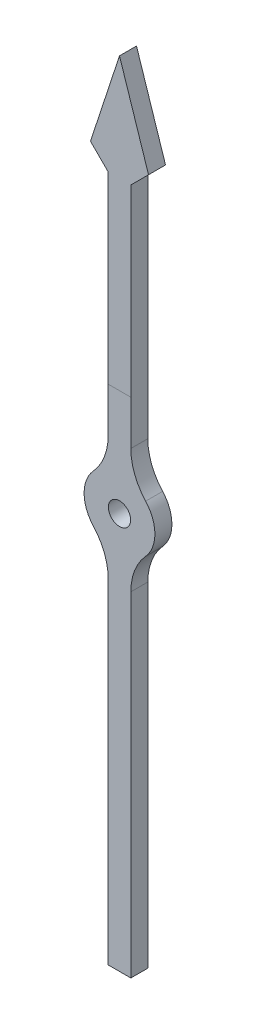
ISO-10303-21;
HEADER;
FILE_DESCRIPTION(('STEP AP214'),'2;1');
FILE_NAME('part.step','',(''),(''),'','','');
FILE_SCHEMA(('AUTOMOTIVE_DESIGN { 1 0 10303 214 1 1 1 1 }'));
ENDSEC;
DATA;
#1=APPLICATION_CONTEXT('core data for automotive mechanical design processes');
#2=APPLICATION_PROTOCOL_DEFINITION('international standard','automotive_design',2000,#1);
#3=PRODUCT_CONTEXT('',#1,'mechanical');
#4=PRODUCT('Part','Part','',(#3));
#5=PRODUCT_RELATED_PRODUCT_CATEGORY('part','',(#4));
#6=PRODUCT_DEFINITION_FORMATION('','',#4);
#7=PRODUCT_DEFINITION_CONTEXT('part definition',#1,'design');
#8=PRODUCT_DEFINITION('design','',#6,#7);
#9=PRODUCT_DEFINITION_SHAPE('','',#8);
#10=(LENGTH_UNIT() NAMED_UNIT(*) SI_UNIT(.MILLI.,.METRE.));
#11=(NAMED_UNIT(*) PLANE_ANGLE_UNIT() SI_UNIT($,.RADIAN.));
#12=(NAMED_UNIT(*) SI_UNIT($,.STERADIAN.) SOLID_ANGLE_UNIT());
#13=UNCERTAINTY_MEASURE_WITH_UNIT(LENGTH_MEASURE(1.E-05),#10,'distance_accuracy_value','');
#14=(GEOMETRIC_REPRESENTATION_CONTEXT(3) GLOBAL_UNCERTAINTY_ASSIGNED_CONTEXT((#13)) GLOBAL_UNIT_ASSIGNED_CONTEXT((#10,
#11,#12)) REPRESENTATION_CONTEXT('',''));
#15=CARTESIAN_POINT('',(0.,0.,0.));
#16=DIRECTION('',(0.,0.,1.));
#17=DIRECTION('',(1.,0.,0.));
#18=AXIS2_PLACEMENT_3D('',#15,#16,#17);
#19=CARTESIAN_POINT('',(0.,0.,0.762));
#20=DIRECTION('',(0.,0.,1.));
#21=DIRECTION('',(1.,0.,0.));
#22=AXIS2_PLACEMENT_3D('',#19,#20,#21);
#23=PLANE('',#22);
#24=CARTESIAN_POINT('',(0.,0.,0.762));
#25=DIRECTION('',(0.,0.,1.));
#26=DIRECTION('',(1.,0.,0.));
#27=AXIS2_PLACEMENT_3D('',#24,#25,#26);
#28=CIRCLE('',#27,0.5);
#29=CARTESIAN_POINT('',(0.5,0.,0.762));
#30=VERTEX_POINT('',#29);
#31=EDGE_CURVE('E201',#30,#30,#28,.T.);
#32=ORIENTED_EDGE('',*,*,#31,.F.);
#33=EDGE_LOOP('',(#32));
#34=FACE_BOUND('',#33,.T.);
#35=CARTESIAN_POINT('',(0.,0.,0.762));
#36=DIRECTION('',(0.,0.,1.));
#37=DIRECTION('',(1.,0.,0.));
#38=AXIS2_PLACEMENT_3D('',#35,#36,#37);
#39=CIRCLE('',#38,1.5875);
#40=CARTESIAN_POINT('',(1.17230769230769,-1.07044426503962,0.762));
#41=VERTEX_POINT('',#40);
#42=CARTESIAN_POINT('',(1.17230769230769,1.07044426503962,0.762));
#43=VERTEX_POINT('',#42);
#44=EDGE_CURVE('E160',#41,#43,#39,.T.);
#45=ORIENTED_EDGE('',*,*,#44,.T.);
#46=CARTESIAN_POINT('',(3.048,2.78315508910301,0.762));
#47=DIRECTION('',(0.,0.,1.));
#48=DIRECTION('',(1.,0.,0.));
#49=AXIS2_PLACEMENT_3D('',#46,#47,#48);
#50=CIRCLE('',#49,2.54);
#51=CARTESIAN_POINT('',(0.508,2.78315508910301,0.762));
#52=VERTEX_POINT('',#51);
#53=EDGE_CURVE('E268',#43,#52,#50,.F.);
#54=ORIENTED_EDGE('',*,*,#53,.T.);
#55=DIRECTION('',(0.,1.,0.));
#56=VECTOR('',#55,1.);
#57=CARTESIAN_POINT('',(0.508,1.50402534885553,0.762));
#58=LINE('',#57,#56);
#59=CARTESIAN_POINT('',(0.508,4.7752,0.762));
#60=VERTEX_POINT('',#59);
#61=EDGE_CURVE('E159',#52,#60,#58,.T.);
#62=ORIENTED_EDGE('',*,*,#61,.T.);
#63=DIRECTION('',(-1.,0.,0.));
#64=VECTOR('',#63,1.);
#65=CARTESIAN_POINT('',(0.,4.7752,0.762));
#66=LINE('',#65,#64);
#67=CARTESIAN_POINT('',(-0.508,4.7752,0.762));
#68=VERTEX_POINT('',#67);
#69=EDGE_CURVE('E156',#60,#68,#66,.T.);
#70=ORIENTED_EDGE('',*,*,#69,.T.);
#71=DIRECTION('',(0.,-1.,0.));
#72=VECTOR('',#71,1.);
#73=CARTESIAN_POINT('',(-0.508,1.50402534885553,0.762));
#74=LINE('',#73,#72);
#75=CARTESIAN_POINT('',(-0.508,2.78315508910301,0.762));
#76=VERTEX_POINT('',#75);
#77=EDGE_CURVE('E184',#68,#76,#74,.T.);
#78=ORIENTED_EDGE('',*,*,#77,.T.);
#79=CARTESIAN_POINT('',(-3.048,2.78315508910301,0.762));
#80=DIRECTION('',(0.,0.,1.));
#81=DIRECTION('',(1.,0.,0.));
#82=AXIS2_PLACEMENT_3D('',#79,#80,#81);
#83=CIRCLE('',#82,2.54);
#84=CARTESIAN_POINT('',(-1.17230769230769,1.07044426503962,0.762));
#85=VERTEX_POINT('',#84);
#86=EDGE_CURVE('E11',#76,#85,#83,.F.);
#87=ORIENTED_EDGE('',*,*,#86,.T.);
#88=CARTESIAN_POINT('',(0.,0.,0.762));
#89=DIRECTION('',(0.,0.,1.));
#90=DIRECTION('',(1.,0.,0.));
#91=AXIS2_PLACEMENT_3D('',#88,#89,#90);
#92=CIRCLE('',#91,1.5875);
#93=CARTESIAN_POINT('',(-1.17230769230769,-1.07044426503962,0.762));
#94=VERTEX_POINT('',#93);
#95=EDGE_CURVE('E187',#85,#94,#92,.T.);
#96=ORIENTED_EDGE('',*,*,#95,.T.);
#97=CARTESIAN_POINT('',(-3.048,-2.78315508910301,0.762));
#98=DIRECTION('',(0.,0.,1.));
#99=DIRECTION('',(1.,0.,0.));
#100=AXIS2_PLACEMENT_3D('',#97,#98,#99);
#101=CIRCLE('',#100,2.54);
#102=CARTESIAN_POINT('',(-0.508,-2.78315508910301,0.762));
#103=VERTEX_POINT('',#102);
#104=EDGE_CURVE('E260',#94,#103,#101,.F.);
#105=ORIENTED_EDGE('',*,*,#104,.T.);
#106=DIRECTION('',(0.,-1.,0.));
#107=VECTOR('',#106,1.);
#108=CARTESIAN_POINT('',(-0.508,-1.50402534885553,0.762));
#109=LINE('',#108,#107);
#110=CARTESIAN_POINT('',(-0.507999999999998,-17.78,0.762));
#111=VERTEX_POINT('',#110);
#112=EDGE_CURVE('E190',#103,#111,#109,.T.);
#113=ORIENTED_EDGE('',*,*,#112,.T.);
#114=DIRECTION('',(1.,0.,0.));
#115=VECTOR('',#114,1.);
#116=CARTESIAN_POINT('',(-0.507999999999998,-17.78,0.762));
#117=LINE('',#116,#115);
#118=CARTESIAN_POINT('',(0.508000000000002,-17.78,0.762));
#119=VERTEX_POINT('',#118);
#120=EDGE_CURVE('E192',#111,#119,#117,.T.);
#121=ORIENTED_EDGE('',*,*,#120,.T.);
#122=DIRECTION('',(0.,1.,0.));
#123=VECTOR('',#122,1.);
#124=CARTESIAN_POINT('',(0.508,-1.50402534885553,0.762));
#125=LINE('',#124,#123);
#126=CARTESIAN_POINT('',(0.508,-2.78315508910301,0.762));
#127=VERTEX_POINT('',#126);
#128=EDGE_CURVE('E194',#119,#127,#125,.T.);
#129=ORIENTED_EDGE('',*,*,#128,.T.);
#130=CARTESIAN_POINT('',(3.048,-2.78315508910301,0.762));
#131=DIRECTION('',(0.,0.,1.));
#132=DIRECTION('',(1.,0.,0.));
#133=AXIS2_PLACEMENT_3D('',#130,#131,#132);
#134=CIRCLE('',#133,2.54);
#135=EDGE_CURVE('E264',#127,#41,#134,.F.);
#136=ORIENTED_EDGE('',*,*,#135,.T.);
#137=EDGE_LOOP('',(#45,#54,#62,#70,#78,#87,#96,#105,#113,#121,#129,#136));
#138=FACE_BOUND('',#137,.T.);
#139=ADVANCED_FACE('F36',(#34,#138),#23,.T.);
#140=ORIENTED_EDGE('',*,*,#69,.F.);
#141=CARTESIAN_POINT('',(0.508,13.0175,0.762));
#142=VERTEX_POINT('',#141);
#143=EDGE_CURVE('E149',#60,#142,#58,.T.);
#144=ORIENTED_EDGE('',*,*,#143,.T.);
#145=DIRECTION('',(0.707106781186548,0.707106781186547,0.));
#146=VECTOR('',#145,1.);
#147=CARTESIAN_POINT('',(0.508,13.0175,0.762));
#148=LINE('',#147,#146);
#149=CARTESIAN_POINT('',(1.30175,13.81125,0.762));
#150=VERTEX_POINT('',#149);
#151=EDGE_CURVE('E153',#142,#150,#148,.T.);
#152=ORIENTED_EDGE('',*,*,#151,.T.);
#153=DIRECTION('',(-0.311663186766481,0.950192642580735,0.));
#154=VECTOR('',#153,1.);
#155=CARTESIAN_POINT('',(1.30175,13.81125,0.762));
#156=LINE('',#155,#154);
#157=CARTESIAN_POINT('',(0.,17.78,0.762));
#158=VERTEX_POINT('',#157);
#159=EDGE_CURVE('E175',#150,#158,#156,.T.);
#160=ORIENTED_EDGE('',*,*,#159,.T.);
#161=DIRECTION('',(-0.311663186766481,-0.950192642580735,0.));
#162=VECTOR('',#161,1.);
#163=CARTESIAN_POINT('',(-1.30175,13.81125,0.762));
#164=LINE('',#163,#162);
#165=CARTESIAN_POINT('',(-1.30175,13.81125,0.762));
#166=VERTEX_POINT('',#165);
#167=EDGE_CURVE('E177',#158,#166,#164,.T.);
#168=ORIENTED_EDGE('',*,*,#167,.T.);
#169=DIRECTION('',(0.707106781186548,-0.707106781186547,0.));
#170=VECTOR('',#169,1.);
#171=CARTESIAN_POINT('',(-0.508,13.0175,0.762));
#172=LINE('',#171,#170);
#173=CARTESIAN_POINT('',(-0.508,13.0175,0.762));
#174=VERTEX_POINT('',#173);
#175=EDGE_CURVE('E182',#166,#174,#172,.T.);
#176=ORIENTED_EDGE('',*,*,#175,.T.);
#177=EDGE_CURVE('E185',#174,#68,#74,.T.);
#178=ORIENTED_EDGE('',*,*,#177,.T.);
#179=EDGE_LOOP('',(#140,#144,#152,#160,#168,#176,#178));
#180=FACE_BOUND('',#179,.T.);
#181=ADVANCED_FACE('F151',(#180),#23,.T.);
#182=CARTESIAN_POINT('',(0.,0.,0.));
#183=DIRECTION('',(0.,0.,1.));
#184=DIRECTION('',(1.,0.,0.));
#185=AXIS2_PLACEMENT_3D('',#182,#183,#184);
#186=PLANE('',#185);
#187=CARTESIAN_POINT('',(0.,0.,0.));
#188=DIRECTION('',(0.,0.,1.));
#189=DIRECTION('',(1.,0.,0.));
#190=AXIS2_PLACEMENT_3D('',#187,#188,#189);
#191=CIRCLE('',#190,1.5875);
#192=CARTESIAN_POINT('',(1.17230769230769,-1.07044426503962,0.));
#193=VERTEX_POINT('',#192);
#194=CARTESIAN_POINT('',(1.17230769230769,1.07044426503962,0.));
#195=VERTEX_POINT('',#194);
#196=EDGE_CURVE('E198',#193,#195,#191,.T.);
#197=ORIENTED_EDGE('',*,*,#196,.F.);
#198=CARTESIAN_POINT('',(3.048,-2.78315508910301,0.));
#199=DIRECTION('',(0.,0.,1.));
#200=DIRECTION('',(1.,0.,0.));
#201=AXIS2_PLACEMENT_3D('',#198,#199,#200);
#202=CIRCLE('',#201,2.54);
#203=CARTESIAN_POINT('',(0.508,-2.78315508910301,0.));
#204=VERTEX_POINT('',#203);
#205=EDGE_CURVE('E262',#193,#204,#202,.T.);
#206=ORIENTED_EDGE('',*,*,#205,.T.);
#207=DIRECTION('',(0.,1.,0.));
#208=VECTOR('',#207,1.);
#209=CARTESIAN_POINT('',(0.508,-1.50402534885553,0.));
#210=LINE('',#209,#208);
#211=CARTESIAN_POINT('',(0.508000000000002,-17.78,0.));
#212=VERTEX_POINT('',#211);
#213=EDGE_CURVE('E220',#212,#204,#210,.T.);
#214=ORIENTED_EDGE('',*,*,#213,.F.);
#215=DIRECTION('',(1.,0.,0.));
#216=VECTOR('',#215,1.);
#217=CARTESIAN_POINT('',(-0.507999999999998,-17.78,0.));
#218=LINE('',#217,#216);
#219=CARTESIAN_POINT('',(-0.507999999999998,-17.78,0.));
#220=VERTEX_POINT('',#219);
#221=EDGE_CURVE('E218',#220,#212,#218,.T.);
#222=ORIENTED_EDGE('',*,*,#221,.F.);
#223=DIRECTION('',(0.,-1.,0.));
#224=VECTOR('',#223,1.);
#225=CARTESIAN_POINT('',(-0.508,-1.50402534885553,0.));
#226=LINE('',#225,#224);
#227=CARTESIAN_POINT('',(-0.508,-2.78315508910301,0.));
#228=VERTEX_POINT('',#227);
#229=EDGE_CURVE('E216',#228,#220,#226,.T.);
#230=ORIENTED_EDGE('',*,*,#229,.F.);
#231=CARTESIAN_POINT('',(-3.048,-2.78315508910301,0.));
#232=DIRECTION('',(0.,0.,1.));
#233=DIRECTION('',(1.,0.,0.));
#234=AXIS2_PLACEMENT_3D('',#231,#232,#233);
#235=CIRCLE('',#234,2.54);
#236=CARTESIAN_POINT('',(-1.17230769230769,-1.07044426503962,0.));
#237=VERTEX_POINT('',#236);
#238=EDGE_CURVE('E258',#228,#237,#235,.T.);
#239=ORIENTED_EDGE('',*,*,#238,.T.);
#240=CARTESIAN_POINT('',(0.,0.,0.));
#241=DIRECTION('',(0.,0.,1.));
#242=DIRECTION('',(1.,0.,0.));
#243=AXIS2_PLACEMENT_3D('',#240,#241,#242);
#244=CIRCLE('',#243,1.5875);
#245=CARTESIAN_POINT('',(-1.17230769230769,1.07044426503962,0.));
#246=VERTEX_POINT('',#245);
#247=EDGE_CURVE('E213',#246,#237,#244,.T.);
#248=ORIENTED_EDGE('',*,*,#247,.F.);
#249=CARTESIAN_POINT('',(-3.048,2.78315508910301,0.));
#250=DIRECTION('',(0.,0.,1.));
#251=DIRECTION('',(1.,0.,0.));
#252=AXIS2_PLACEMENT_3D('',#249,#250,#251);
#253=CIRCLE('',#252,2.54);
#254=CARTESIAN_POINT('',(-0.508,2.78315508910301,0.));
#255=VERTEX_POINT('',#254);
#256=EDGE_CURVE('E44',#246,#255,#253,.T.);
#257=ORIENTED_EDGE('',*,*,#256,.T.);
#258=DIRECTION('',(0.,-1.,0.));
#259=VECTOR('',#258,1.);
#260=CARTESIAN_POINT('',(-0.508,1.50402534885553,0.));
#261=LINE('',#260,#259);
#262=CARTESIAN_POINT('',(-0.508,13.0175,0.));
#263=VERTEX_POINT('',#262);
#264=EDGE_CURVE('E211',#263,#255,#261,.T.);
#265=ORIENTED_EDGE('',*,*,#264,.F.);
#266=DIRECTION('',(0.707106781186548,-0.707106781186547,0.));
#267=VECTOR('',#266,1.);
#268=CARTESIAN_POINT('',(-0.508,13.0175,0.));
#269=LINE('',#268,#267);
#270=CARTESIAN_POINT('',(-1.30175,13.81125,0.));
#271=VERTEX_POINT('',#270);
#272=EDGE_CURVE('E209',#271,#263,#269,.T.);
#273=ORIENTED_EDGE('',*,*,#272,.F.);
#274=DIRECTION('',(-0.311663186766481,-0.950192642580735,0.));
#275=VECTOR('',#274,1.);
#276=CARTESIAN_POINT('',(-1.30175,13.81125,0.));
#277=LINE('',#276,#275);
#278=CARTESIAN_POINT('',(0.,17.78,0.));
#279=VERTEX_POINT('',#278);
#280=EDGE_CURVE('E207',#279,#271,#277,.T.);
#281=ORIENTED_EDGE('',*,*,#280,.F.);
#282=DIRECTION('',(-0.311663186766481,0.950192642580735,0.));
#283=VECTOR('',#282,1.);
#284=CARTESIAN_POINT('',(1.30175,13.81125,0.));
#285=LINE('',#284,#283);
#286=CARTESIAN_POINT('',(1.30175,13.81125,0.));
#287=VERTEX_POINT('',#286);
#288=EDGE_CURVE('E205',#287,#279,#285,.T.);
#289=ORIENTED_EDGE('',*,*,#288,.F.);
#290=DIRECTION('',(0.707106781186548,0.707106781186547,0.));
#291=VECTOR('',#290,1.);
#292=CARTESIAN_POINT('',(0.508,13.0175,0.));
#293=LINE('',#292,#291);
#294=CARTESIAN_POINT('',(0.508,13.0175,0.));
#295=VERTEX_POINT('',#294);
#296=EDGE_CURVE('E203',#295,#287,#293,.T.);
#297=ORIENTED_EDGE('',*,*,#296,.F.);
#298=DIRECTION('',(0.,1.,0.));
#299=VECTOR('',#298,1.);
#300=CARTESIAN_POINT('',(0.508,1.50402534885553,0.));
#301=LINE('',#300,#299);
#302=CARTESIAN_POINT('',(0.508,2.78315508910301,0.));
#303=VERTEX_POINT('',#302);
#304=EDGE_CURVE('E167',#303,#295,#301,.T.);
#305=ORIENTED_EDGE('',*,*,#304,.F.);
#306=CARTESIAN_POINT('',(3.048,2.78315508910301,0.));
#307=DIRECTION('',(0.,0.,1.));
#308=DIRECTION('',(1.,0.,0.));
#309=AXIS2_PLACEMENT_3D('',#306,#307,#308);
#310=CIRCLE('',#309,2.54);
#311=EDGE_CURVE('E266',#303,#195,#310,.T.);
#312=ORIENTED_EDGE('',*,*,#311,.T.);
#313=EDGE_LOOP('',(#197,#206,#214,#222,#230,#239,#248,#257,#265,#273,#281,#289,#297,#305,#312));
#314=FACE_BOUND('',#313,.T.);
#315=CARTESIAN_POINT('',(0.,0.,0.));
#316=DIRECTION('',(0.,0.,1.));
#317=DIRECTION('',(1.,0.,0.));
#318=AXIS2_PLACEMENT_3D('',#315,#316,#317);
#319=CIRCLE('',#318,0.5);
#320=CARTESIAN_POINT('',(0.5,0.,0.));
#321=VERTEX_POINT('',#320);
#322=EDGE_CURVE('E454',#321,#321,#319,.T.);
#323=ORIENTED_EDGE('',*,*,#322,.T.);
#324=EDGE_LOOP('',(#323));
#325=FACE_BOUND('',#324,.T.);
#326=ADVANCED_FACE('F278',(#314,#325),#186,.F.);
#327=CARTESIAN_POINT('',(0.,0.,0.762));
#328=DIRECTION('',(0.,0.,-1.));
#329=DIRECTION('',(-1.,0.,0.));
#330=AXIS2_PLACEMENT_3D('',#327,#328,#329);
#331=CYLINDRICAL_SURFACE('',#330,1.5875);
#332=ORIENTED_EDGE('',*,*,#44,.F.);
#333=DIRECTION('',(0.,0.,-1.));
#334=VECTOR('',#333,1.);
#335=CARTESIAN_POINT('',(1.17230769230769,-1.07044426503962,0.762));
#336=LINE('',#335,#334);
#337=EDGE_CURVE('E250',#41,#193,#336,.T.);
#338=ORIENTED_EDGE('',*,*,#337,.T.);
#339=ORIENTED_EDGE('',*,*,#196,.T.);
#340=DIRECTION('',(0.,0.,-1.));
#341=VECTOR('',#340,1.);
#342=CARTESIAN_POINT('',(1.17230769230769,1.07044426503962,0.762));
#343=LINE('',#342,#341);
#344=EDGE_CURVE('E248',#195,#43,#343,.F.);
#345=ORIENTED_EDGE('',*,*,#344,.T.);
#346=EDGE_LOOP('',(#332,#338,#339,#345));
#347=FACE_BOUND('',#346,.T.);
#348=ADVANCED_FACE('F281',(#347),#331,.T.);
#349=CARTESIAN_POINT('',(0.508,1.50402534885553,0.762));
#350=DIRECTION('',(-1.,0.,0.));
#351=DIRECTION('',(0.,0.,1.));
#352=AXIS2_PLACEMENT_3D('',#349,#350,#351);
#353=PLANE('',#352);
#354=ORIENTED_EDGE('',*,*,#61,.F.);
#355=DIRECTION('',(0.,0.,1.));
#356=VECTOR('',#355,1.);
#357=CARTESIAN_POINT('',(0.508,2.78315508910301,0.));
#358=LINE('',#357,#356);
#359=EDGE_CURVE('E255',#52,#303,#358,.F.);
#360=ORIENTED_EDGE('',*,*,#359,.T.);
#361=ORIENTED_EDGE('',*,*,#304,.T.);
#362=DIRECTION('',(0.,0.,-1.));
#363=VECTOR('',#362,1.);
#364=CARTESIAN_POINT('',(0.508,13.0175,0.762));
#365=LINE('',#364,#363);
#366=EDGE_CURVE('E163',#142,#295,#365,.T.);
#367=ORIENTED_EDGE('',*,*,#366,.F.);
#368=ORIENTED_EDGE('',*,*,#143,.F.);
#369=EDGE_LOOP('',(#354,#360,#361,#367,#368));
#370=FACE_BOUND('',#369,.T.);
#371=ADVANCED_FACE('F164',(#370),#353,.F.);
#372=CARTESIAN_POINT('',(0.508,13.0175,0.762));
#373=DIRECTION('',(-0.707106781186547,0.707106781186548,0.));
#374=DIRECTION('',(-0.707106781186548,-0.707106781186547,0.));
#375=AXIS2_PLACEMENT_3D('',#372,#373,#374);
#376=PLANE('',#375);
#377=ORIENTED_EDGE('',*,*,#296,.T.);
#378=DIRECTION('',(0.,0.,-1.));
#379=VECTOR('',#378,1.);
#380=CARTESIAN_POINT('',(1.30175,13.81125,0.762));
#381=LINE('',#380,#379);
#382=EDGE_CURVE('E170',#150,#287,#381,.T.);
#383=ORIENTED_EDGE('',*,*,#382,.F.);
#384=ORIENTED_EDGE('',*,*,#151,.F.);
#385=ORIENTED_EDGE('',*,*,#366,.T.);
#386=EDGE_LOOP('',(#377,#383,#384,#385));
#387=FACE_BOUND('',#386,.T.);
#388=ADVANCED_FACE('F172',(#387),#376,.F.);
#389=CARTESIAN_POINT('',(1.30175,13.81125,0.762));
#390=DIRECTION('',(-0.950192642580735,-0.311663186766481,0.));
#391=DIRECTION('',(0.311663186766481,-0.950192642580736,0.));
#392=AXIS2_PLACEMENT_3D('',#389,#390,#391);
#393=PLANE('',#392);
#394=ORIENTED_EDGE('',*,*,#288,.T.);
#395=DIRECTION('',(0.,0.,-1.));
#396=VECTOR('',#395,1.);
#397=CARTESIAN_POINT('',(0.,17.78,0.762));
#398=LINE('',#397,#396);
#399=EDGE_CURVE('E234',#158,#279,#398,.T.);
#400=ORIENTED_EDGE('',*,*,#399,.F.);
#401=ORIENTED_EDGE('',*,*,#159,.F.);
#402=ORIENTED_EDGE('',*,*,#382,.T.);
#403=EDGE_LOOP('',(#394,#400,#401,#402));
#404=FACE_BOUND('',#403,.T.);
#405=ADVANCED_FACE('F346',(#404),#393,.F.);
#406=CARTESIAN_POINT('',(-1.30175,13.81125,0.762));
#407=DIRECTION('',(0.950192642580735,-0.311663186766481,0.));
#408=DIRECTION('',(0.311663186766481,0.950192642580736,0.));
#409=AXIS2_PLACEMENT_3D('',#406,#407,#408);
#410=PLANE('',#409);
#411=ORIENTED_EDGE('',*,*,#280,.T.);
#412=DIRECTION('',(0.,0.,-1.));
#413=VECTOR('',#412,1.);
#414=CARTESIAN_POINT('',(-1.30175,13.81125,0.762));
#415=LINE('',#414,#413);
#416=EDGE_CURVE('E231',#166,#271,#415,.T.);
#417=ORIENTED_EDGE('',*,*,#416,.F.);
#418=ORIENTED_EDGE('',*,*,#167,.F.);
#419=ORIENTED_EDGE('',*,*,#399,.T.);
#420=EDGE_LOOP('',(#411,#417,#418,#419));
#421=FACE_BOUND('',#420,.T.);
#422=ADVANCED_FACE('F342',(#421),#410,.F.);
#423=CARTESIAN_POINT('',(-0.508,13.0175,0.762));
#424=DIRECTION('',(0.707106781186547,0.707106781186548,0.));
#425=DIRECTION('',(-0.707106781186548,0.707106781186547,0.));
#426=AXIS2_PLACEMENT_3D('',#423,#424,#425);
#427=PLANE('',#426);
#428=ORIENTED_EDGE('',*,*,#272,.T.);
#429=DIRECTION('',(0.,0.,-1.));
#430=VECTOR('',#429,1.);
#431=CARTESIAN_POINT('',(-0.508,13.0175,0.762));
#432=LINE('',#431,#430);
#433=EDGE_CURVE('E228',#174,#263,#432,.T.);
#434=ORIENTED_EDGE('',*,*,#433,.F.);
#435=ORIENTED_EDGE('',*,*,#175,.F.);
#436=ORIENTED_EDGE('',*,*,#416,.T.);
#437=EDGE_LOOP('',(#428,#434,#435,#436));
#438=FACE_BOUND('',#437,.T.);
#439=ADVANCED_FACE('F339',(#438),#427,.F.);
#440=CARTESIAN_POINT('',(-0.508,1.50402534885553,0.762));
#441=DIRECTION('',(1.,0.,0.));
#442=DIRECTION('',(0.,0.,-1.));
#443=AXIS2_PLACEMENT_3D('',#440,#441,#442);
#444=PLANE('',#443);
#445=ORIENTED_EDGE('',*,*,#264,.T.);
#446=DIRECTION('',(0.,0.,1.));
#447=VECTOR('',#446,1.);
#448=CARTESIAN_POINT('',(-0.508,2.78315508910301,0.762));
#449=LINE('',#448,#447);
#450=EDGE_CURVE('E51',#255,#76,#449,.T.);
#451=ORIENTED_EDGE('',*,*,#450,.T.);
#452=ORIENTED_EDGE('',*,*,#77,.F.);
#453=ORIENTED_EDGE('',*,*,#177,.F.);
#454=ORIENTED_EDGE('',*,*,#433,.T.);
#455=EDGE_LOOP('',(#445,#451,#452,#453,#454));
#456=FACE_BOUND('',#455,.T.);
#457=ADVANCED_FACE('F336',(#456),#444,.F.);
#458=CARTESIAN_POINT('',(0.,0.,0.762));
#459=DIRECTION('',(0.,0.,-1.));
#460=DIRECTION('',(-1.,0.,0.));
#461=AXIS2_PLACEMENT_3D('',#458,#459,#460);
#462=CYLINDRICAL_SURFACE('',#461,1.5875);
#463=ORIENTED_EDGE('',*,*,#247,.T.);
#464=DIRECTION('',(0.,0.,-1.));
#465=VECTOR('',#464,1.);
#466=CARTESIAN_POINT('',(-1.17230769230769,-1.07044426503962,0.762));
#467=LINE('',#466,#465);
#468=EDGE_CURVE('E246',#237,#94,#467,.F.);
#469=ORIENTED_EDGE('',*,*,#468,.T.);
#470=ORIENTED_EDGE('',*,*,#95,.F.);
#471=DIRECTION('',(0.,0.,-1.));
#472=VECTOR('',#471,1.);
#473=CARTESIAN_POINT('',(-1.17230769230769,1.07044426503962,0.762));
#474=LINE('',#473,#472);
#475=EDGE_CURVE('E243',#85,#246,#474,.T.);
#476=ORIENTED_EDGE('',*,*,#475,.T.);
#477=EDGE_LOOP('',(#463,#469,#470,#476));
#478=FACE_BOUND('',#477,.T.);
#479=ADVANCED_FACE('F308',(#478),#462,.T.);
#480=CARTESIAN_POINT('',(-0.508,-1.50402534885553,0.762));
#481=DIRECTION('',(1.,0.,0.));
#482=DIRECTION('',(0.,1.,0.));
#483=AXIS2_PLACEMENT_3D('',#480,#481,#482);
#484=PLANE('',#483);
#485=ORIENTED_EDGE('',*,*,#112,.F.);
#486=DIRECTION('',(0.,0.,1.));
#487=VECTOR('',#486,1.);
#488=CARTESIAN_POINT('',(-0.508,-2.78315508910301,0.));
#489=LINE('',#488,#487);
#490=EDGE_CURVE('E240',#103,#228,#489,.F.);
#491=ORIENTED_EDGE('',*,*,#490,.T.);
#492=ORIENTED_EDGE('',*,*,#229,.T.);
#493=DIRECTION('',(0.,0.,-1.));
#494=VECTOR('',#493,1.);
#495=CARTESIAN_POINT('',(-0.507999999999998,-17.78,0.762));
#496=LINE('',#495,#494);
#497=EDGE_CURVE('E225',#111,#220,#496,.T.);
#498=ORIENTED_EDGE('',*,*,#497,.F.);
#499=EDGE_LOOP('',(#485,#491,#492,#498));
#500=FACE_BOUND('',#499,.T.);
#501=ADVANCED_FACE('F300',(#500),#484,.F.);
#502=CARTESIAN_POINT('',(-0.507999999999998,-17.78,0.762));
#503=DIRECTION('',(0.,1.,0.));
#504=DIRECTION('',(0.,0.,1.));
#505=AXIS2_PLACEMENT_3D('',#502,#503,#504);
#506=PLANE('',#505);
#507=ORIENTED_EDGE('',*,*,#221,.T.);
#508=DIRECTION('',(0.,0.,-1.));
#509=VECTOR('',#508,1.);
#510=CARTESIAN_POINT('',(0.508000000000002,-17.78,0.762));
#511=LINE('',#510,#509);
#512=EDGE_CURVE('E197',#119,#212,#511,.T.);
#513=ORIENTED_EDGE('',*,*,#512,.F.);
#514=ORIENTED_EDGE('',*,*,#120,.F.);
#515=ORIENTED_EDGE('',*,*,#497,.T.);
#516=EDGE_LOOP('',(#507,#513,#514,#515));
#517=FACE_BOUND('',#516,.T.);
#518=ADVANCED_FACE('F295',(#517),#506,.F.);
#519=CARTESIAN_POINT('',(0.508,-1.50402534885553,0.762));
#520=DIRECTION('',(-1.,0.,0.));
#521=DIRECTION('',(0.,-1.,0.));
#522=AXIS2_PLACEMENT_3D('',#519,#520,#521);
#523=PLANE('',#522);
#524=ORIENTED_EDGE('',*,*,#213,.T.);
#525=DIRECTION('',(0.,0.,1.));
#526=VECTOR('',#525,1.);
#527=CARTESIAN_POINT('',(0.508,-2.78315508910301,0.762));
#528=LINE('',#527,#526);
#529=EDGE_CURVE('E253',#204,#127,#528,.T.);
#530=ORIENTED_EDGE('',*,*,#529,.T.);
#531=ORIENTED_EDGE('',*,*,#128,.F.);
#532=ORIENTED_EDGE('',*,*,#512,.T.);
#533=EDGE_LOOP('',(#524,#530,#531,#532));
#534=FACE_BOUND('',#533,.T.);
#535=ADVANCED_FACE('F290',(#534),#523,.F.);
#536=CARTESIAN_POINT('',(0.,0.,0.762));
#537=DIRECTION('',(0.,0.,-1.));
#538=DIRECTION('',(-1.,0.,0.));
#539=AXIS2_PLACEMENT_3D('',#536,#537,#538);
#540=CYLINDRICAL_SURFACE('',#539,0.5);
#541=ORIENTED_EDGE('',*,*,#31,.T.);
#542=EDGE_LOOP('',(#541));
#543=FACE_BOUND('',#542,.T.);
#544=ORIENTED_EDGE('',*,*,#322,.F.);
#545=EDGE_LOOP('',(#544));
#546=FACE_BOUND('',#545,.T.);
#547=ADVANCED_FACE('F325',(#543,#546),#540,.F.);
#548=CARTESIAN_POINT('',(-3.048,-2.78315508910301,0.762));
#549=DIRECTION('',(0.,0.,-1.));
#550=DIRECTION('',(-1.,0.,0.));
#551=AXIS2_PLACEMENT_3D('',#548,#549,#550);
#552=CYLINDRICAL_SURFACE('',#551,2.54);
#553=ORIENTED_EDGE('',*,*,#104,.F.);
#554=ORIENTED_EDGE('',*,*,#468,.F.);
#555=ORIENTED_EDGE('',*,*,#238,.F.);
#556=ORIENTED_EDGE('',*,*,#490,.F.);
#557=EDGE_LOOP('',(#553,#554,#555,#556));
#558=FACE_BOUND('',#557,.T.);
#559=ADVANCED_FACE('F304',(#558),#552,.F.);
#560=CARTESIAN_POINT('',(3.048,-2.78315508910301,0.762));
#561=DIRECTION('',(0.,0.,-1.));
#562=DIRECTION('',(-1.,0.,0.));
#563=AXIS2_PLACEMENT_3D('',#560,#561,#562);
#564=CYLINDRICAL_SURFACE('',#563,2.54);
#565=ORIENTED_EDGE('',*,*,#135,.F.);
#566=ORIENTED_EDGE('',*,*,#529,.F.);
#567=ORIENTED_EDGE('',*,*,#205,.F.);
#568=ORIENTED_EDGE('',*,*,#337,.F.);
#569=EDGE_LOOP('',(#565,#566,#567,#568));
#570=FACE_BOUND('',#569,.T.);
#571=ADVANCED_FACE('F285',(#570),#564,.F.);
#572=CARTESIAN_POINT('',(3.048,2.78315508910301,0.762));
#573=DIRECTION('',(0.,0.,-1.));
#574=DIRECTION('',(-1.,0.,0.));
#575=AXIS2_PLACEMENT_3D('',#572,#573,#574);
#576=CYLINDRICAL_SURFACE('',#575,2.54);
#577=ORIENTED_EDGE('',*,*,#53,.F.);
#578=ORIENTED_EDGE('',*,*,#344,.F.);
#579=ORIENTED_EDGE('',*,*,#311,.F.);
#580=ORIENTED_EDGE('',*,*,#359,.F.);
#581=EDGE_LOOP('',(#577,#578,#579,#580));
#582=FACE_BOUND('',#581,.T.);
#583=ADVANCED_FACE('F276',(#582),#576,.F.);
#584=CARTESIAN_POINT('',(-3.048,2.78315508910301,0.762));
#585=DIRECTION('',(0.,0.,-1.));
#586=DIRECTION('',(-1.,0.,0.));
#587=AXIS2_PLACEMENT_3D('',#584,#585,#586);
#588=CYLINDRICAL_SURFACE('',#587,2.54);
#589=ORIENTED_EDGE('',*,*,#86,.F.);
#590=ORIENTED_EDGE('',*,*,#450,.F.);
#591=ORIENTED_EDGE('',*,*,#256,.F.);
#592=ORIENTED_EDGE('',*,*,#475,.F.);
#593=EDGE_LOOP('',(#589,#590,#591,#592));
#594=FACE_BOUND('',#593,.T.);
#595=ADVANCED_FACE('F38',(#594),#588,.F.);
#596=CLOSED_SHELL('',(#139,#181,#326,#348,#371,#388,#405,#422,#439,#457,#479,#501,#518,#535,
#547,#559,#571,#583,#595));
#597=MANIFOLD_SOLID_BREP('B2',#596);
#598=ADVANCED_BREP_SHAPE_REPRESENTATION('',(#18,#597),#14);
#599=SHAPE_DEFINITION_REPRESENTATION(#9,#598);
ENDSEC;
END-ISO-10303-21;
